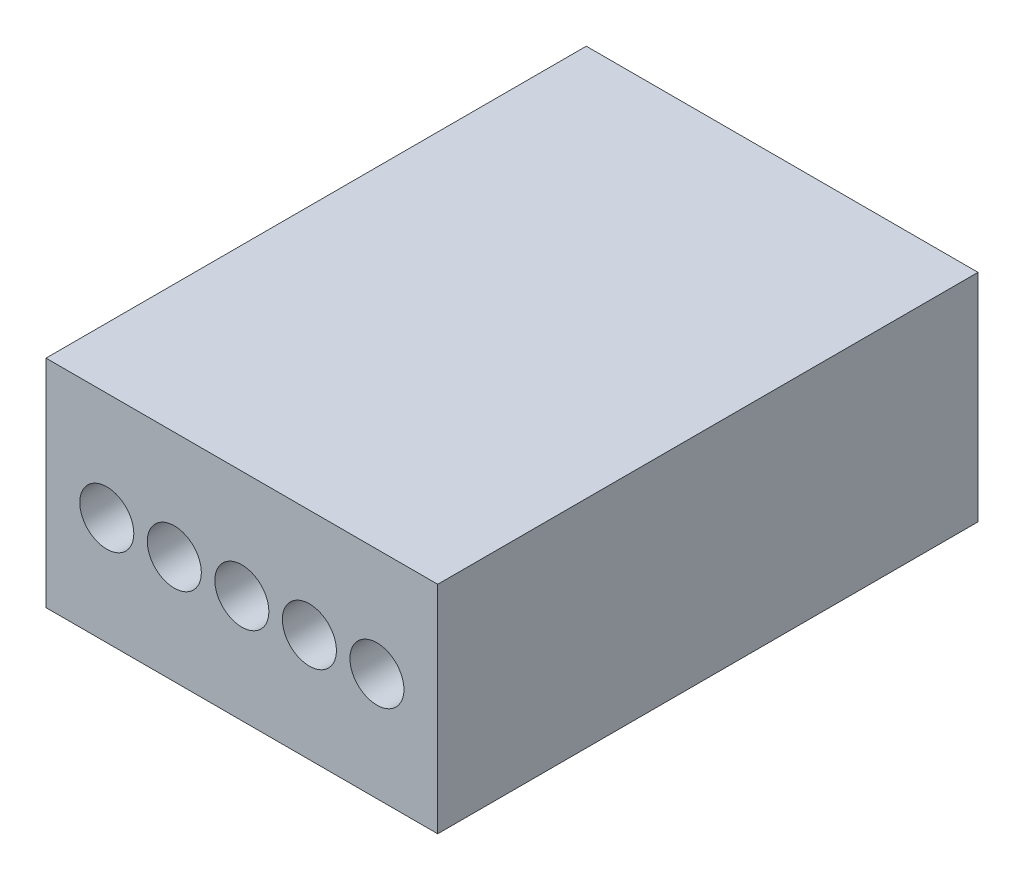
ISO-10303-21;
HEADER;
FILE_DESCRIPTION(('STEP AP214'),'2;1');
FILE_NAME('part.step','',(''),(''),'','','');
FILE_SCHEMA(('AUTOMOTIVE_DESIGN { 1 0 10303 214 1 1 1 1 }'));
ENDSEC;
DATA;
#1=APPLICATION_CONTEXT('core data for automotive mechanical design processes');
#2=APPLICATION_PROTOCOL_DEFINITION('international standard','automotive_design',2000,#1);
#3=PRODUCT_CONTEXT('',#1,'mechanical');
#4=PRODUCT('Part','Part','',(#3));
#5=PRODUCT_RELATED_PRODUCT_CATEGORY('part','',(#4));
#6=PRODUCT_DEFINITION_FORMATION('','',#4);
#7=PRODUCT_DEFINITION_CONTEXT('part definition',#1,'design');
#8=PRODUCT_DEFINITION('design','',#6,#7);
#9=PRODUCT_DEFINITION_SHAPE('','',#8);
#10=(LENGTH_UNIT() NAMED_UNIT(*) SI_UNIT(.MILLI.,.METRE.));
#11=(NAMED_UNIT(*) PLANE_ANGLE_UNIT() SI_UNIT($,.RADIAN.));
#12=(NAMED_UNIT(*) SI_UNIT($,.STERADIAN.) SOLID_ANGLE_UNIT());
#13=UNCERTAINTY_MEASURE_WITH_UNIT(LENGTH_MEASURE(1.E-05),#10,'distance_accuracy_value','');
#14=(GEOMETRIC_REPRESENTATION_CONTEXT(3) GLOBAL_UNCERTAINTY_ASSIGNED_CONTEXT((#13)) GLOBAL_UNIT_ASSIGNED_CONTEXT((#10,
#11,#12)) REPRESENTATION_CONTEXT('',''));
#15=CARTESIAN_POINT('',(0.,0.,0.));
#16=DIRECTION('',(0.,0.,1.));
#17=DIRECTION('',(1.,0.,0.));
#18=AXIS2_PLACEMENT_3D('',#15,#16,#17);
#19=CARTESIAN_POINT('',(0.,0.,10.));
#20=DIRECTION('',(1.,0.,0.));
#21=DIRECTION('',(0.,0.,-1.));
#22=AXIS2_PLACEMENT_3D('',#19,#20,#21);
#23=PLANE('',#22);
#24=DIRECTION('',(0.,-1.,0.));
#25=VECTOR('',#24,1.);
#26=CARTESIAN_POINT('',(0.,0.,0.));
#27=LINE('',#26,#25);
#28=CARTESIAN_POINT('',(0.,4.,0.));
#29=VERTEX_POINT('',#28);
#30=CARTESIAN_POINT('',(0.,0.,0.));
#31=VERTEX_POINT('',#30);
#32=EDGE_CURVE('E107',#29,#31,#27,.T.);
#33=ORIENTED_EDGE('',*,*,#32,.T.);
#34=DIRECTION('',(0.,0.,-1.));
#35=VECTOR('',#34,1.);
#36=CARTESIAN_POINT('',(0.,0.,10.));
#37=LINE('',#36,#35);
#38=CARTESIAN_POINT('',(0.,0.,10.));
#39=VERTEX_POINT('',#38);
#40=EDGE_CURVE('E11',#39,#31,#37,.T.);
#41=ORIENTED_EDGE('',*,*,#40,.F.);
#42=DIRECTION('',(0.,-1.,0.));
#43=VECTOR('',#42,1.);
#44=CARTESIAN_POINT('',(0.,0.,10.));
#45=LINE('',#44,#43);
#46=CARTESIAN_POINT('',(0.,4.,10.));
#47=VERTEX_POINT('',#46);
#48=EDGE_CURVE('E91',#47,#39,#45,.T.);
#49=ORIENTED_EDGE('',*,*,#48,.F.);
#50=DIRECTION('',(0.,0.,-1.));
#51=VECTOR('',#50,1.);
#52=CARTESIAN_POINT('',(0.,4.,10.));
#53=LINE('',#52,#51);
#54=EDGE_CURVE('E103',#47,#29,#53,.T.);
#55=ORIENTED_EDGE('',*,*,#54,.T.);
#56=EDGE_LOOP('',(#33,#41,#49,#55));
#57=FACE_BOUND('',#56,.T.);
#58=ADVANCED_FACE('F39',(#57),#23,.F.);
#59=CARTESIAN_POINT('',(0.,0.,10.));
#60=DIRECTION('',(0.,1.,0.));
#61=DIRECTION('',(0.,0.,1.));
#62=AXIS2_PLACEMENT_3D('',#59,#60,#61);
#63=PLANE('',#62);
#64=DIRECTION('',(1.,0.,0.));
#65=VECTOR('',#64,1.);
#66=CARTESIAN_POINT('',(0.,0.,0.));
#67=LINE('',#66,#65);
#68=CARTESIAN_POINT('',(7.25,0.,0.));
#69=VERTEX_POINT('',#68);
#70=EDGE_CURVE('E96',#31,#69,#67,.T.);
#71=ORIENTED_EDGE('',*,*,#70,.T.);
#72=DIRECTION('',(0.,0.,-1.));
#73=VECTOR('',#72,1.);
#74=CARTESIAN_POINT('',(7.25,0.,10.));
#75=LINE('',#74,#73);
#76=CARTESIAN_POINT('',(7.25,0.,10.));
#77=VERTEX_POINT('',#76);
#78=EDGE_CURVE('E48',#77,#69,#75,.T.);
#79=ORIENTED_EDGE('',*,*,#78,.F.);
#80=DIRECTION('',(1.,0.,0.));
#81=VECTOR('',#80,1.);
#82=CARTESIAN_POINT('',(0.,0.,10.));
#83=LINE('',#82,#81);
#84=EDGE_CURVE('E86',#39,#77,#83,.T.);
#85=ORIENTED_EDGE('',*,*,#84,.F.);
#86=ORIENTED_EDGE('',*,*,#40,.T.);
#87=EDGE_LOOP('',(#71,#79,#85,#86));
#88=FACE_BOUND('',#87,.T.);
#89=ADVANCED_FACE('F95',(#88),#63,.F.);
#90=CARTESIAN_POINT('',(7.25,0.,10.));
#91=DIRECTION('',(-1.,0.,0.));
#92=DIRECTION('',(0.,0.,1.));
#93=AXIS2_PLACEMENT_3D('',#90,#91,#92);
#94=PLANE('',#93);
#95=DIRECTION('',(0.,1.,0.));
#96=VECTOR('',#95,1.);
#97=CARTESIAN_POINT('',(7.25,0.,0.));
#98=LINE('',#97,#96);
#99=CARTESIAN_POINT('',(7.25,4.,0.));
#100=VERTEX_POINT('',#99);
#101=EDGE_CURVE('E73',#69,#100,#98,.T.);
#102=ORIENTED_EDGE('',*,*,#101,.T.);
#103=DIRECTION('',(0.,0.,-1.));
#104=VECTOR('',#103,1.);
#105=CARTESIAN_POINT('',(7.25,4.,10.));
#106=LINE('',#105,#104);
#107=CARTESIAN_POINT('',(7.25,4.,10.));
#108=VERTEX_POINT('',#107);
#109=EDGE_CURVE('E98',#108,#100,#106,.T.);
#110=ORIENTED_EDGE('',*,*,#109,.F.);
#111=DIRECTION('',(0.,1.,0.));
#112=VECTOR('',#111,1.);
#113=CARTESIAN_POINT('',(7.25,0.,10.));
#114=LINE('',#113,#112);
#115=EDGE_CURVE('E89',#77,#108,#114,.T.);
#116=ORIENTED_EDGE('',*,*,#115,.F.);
#117=ORIENTED_EDGE('',*,*,#78,.T.);
#118=EDGE_LOOP('',(#102,#110,#116,#117));
#119=FACE_BOUND('',#118,.T.);
#120=ADVANCED_FACE('F99',(#119),#94,.F.);
#121=CARTESIAN_POINT('',(0.,4.,10.));
#122=DIRECTION('',(0.,-1.,0.));
#123=DIRECTION('',(0.,0.,-1.));
#124=AXIS2_PLACEMENT_3D('',#121,#122,#123);
#125=PLANE('',#124);
#126=DIRECTION('',(-1.,0.,0.));
#127=VECTOR('',#126,1.);
#128=CARTESIAN_POINT('',(0.,4.,0.));
#129=LINE('',#128,#127);
#130=EDGE_CURVE('E79',#100,#29,#129,.T.);
#131=ORIENTED_EDGE('',*,*,#130,.T.);
#132=ORIENTED_EDGE('',*,*,#54,.F.);
#133=DIRECTION('',(-1.,0.,0.));
#134=VECTOR('',#133,1.);
#135=CARTESIAN_POINT('',(0.,4.,10.));
#136=LINE('',#135,#134);
#137=EDGE_CURVE('E56',#108,#47,#136,.T.);
#138=ORIENTED_EDGE('',*,*,#137,.F.);
#139=ORIENTED_EDGE('',*,*,#109,.T.);
#140=EDGE_LOOP('',(#131,#132,#138,#139));
#141=FACE_BOUND('',#140,.T.);
#142=ADVANCED_FACE('F121',(#141),#125,.F.);
#143=CARTESIAN_POINT('',(0.,0.,10.));
#144=DIRECTION('',(0.,0.,-1.));
#145=DIRECTION('',(-1.,0.,0.));
#146=AXIS2_PLACEMENT_3D('',#143,#144,#145);
#147=PLANE('',#146);
#148=CARTESIAN_POINT('',(1.125,2.,10.));
#149=DIRECTION('',(0.,0.,1.));
#150=DIRECTION('',(1.,0.,0.));
#151=AXIS2_PLACEMENT_3D('',#148,#149,#150);
#152=CIRCLE('',#151,0.5);
#153=CARTESIAN_POINT('',(1.625,2.,10.));
#154=VERTEX_POINT('',#153);
#155=EDGE_CURVE('E160',#154,#154,#152,.T.);
#156=ORIENTED_EDGE('',*,*,#155,.F.);
#157=EDGE_LOOP('',(#156));
#158=FACE_BOUND('',#157,.T.);
#159=CARTESIAN_POINT('',(2.375,2.,10.));
#160=DIRECTION('',(0.,0.,1.));
#161=DIRECTION('',(1.,0.,0.));
#162=AXIS2_PLACEMENT_3D('',#159,#160,#161);
#163=CIRCLE('',#162,0.5);
#164=CARTESIAN_POINT('',(2.875,2.,10.));
#165=VERTEX_POINT('',#164);
#166=EDGE_CURVE('E152',#165,#165,#163,.T.);
#167=ORIENTED_EDGE('',*,*,#166,.F.);
#168=EDGE_LOOP('',(#167));
#169=FACE_BOUND('',#168,.T.);
#170=CARTESIAN_POINT('',(3.625,2.,10.));
#171=DIRECTION('',(0.,0.,1.));
#172=DIRECTION('',(1.,0.,0.));
#173=AXIS2_PLACEMENT_3D('',#170,#171,#172);
#174=CIRCLE('',#173,0.5);
#175=CARTESIAN_POINT('',(4.125,2.,10.));
#176=VERTEX_POINT('',#175);
#177=EDGE_CURVE('E144',#176,#176,#174,.T.);
#178=ORIENTED_EDGE('',*,*,#177,.F.);
#179=EDGE_LOOP('',(#178));
#180=FACE_BOUND('',#179,.T.);
#181=CARTESIAN_POINT('',(4.875,2.,10.));
#182=DIRECTION('',(0.,0.,1.));
#183=DIRECTION('',(1.,0.,0.));
#184=AXIS2_PLACEMENT_3D('',#181,#182,#183);
#185=CIRCLE('',#184,0.5);
#186=CARTESIAN_POINT('',(5.375,2.,10.));
#187=VERTEX_POINT('',#186);
#188=EDGE_CURVE('E136',#187,#187,#185,.T.);
#189=ORIENTED_EDGE('',*,*,#188,.F.);
#190=EDGE_LOOP('',(#189));
#191=FACE_BOUND('',#190,.T.);
#192=CARTESIAN_POINT('',(6.125,2.,10.));
#193=DIRECTION('',(0.,0.,1.));
#194=DIRECTION('',(1.,0.,0.));
#195=AXIS2_PLACEMENT_3D('',#192,#193,#194);
#196=CIRCLE('',#195,0.5);
#197=CARTESIAN_POINT('',(6.625,2.,10.));
#198=VERTEX_POINT('',#197);
#199=EDGE_CURVE('E128',#198,#198,#196,.T.);
#200=ORIENTED_EDGE('',*,*,#199,.F.);
#201=EDGE_LOOP('',(#200));
#202=FACE_BOUND('',#201,.T.);
#203=ORIENTED_EDGE('',*,*,#48,.T.);
#204=ORIENTED_EDGE('',*,*,#84,.T.);
#205=ORIENTED_EDGE('',*,*,#115,.T.);
#206=ORIENTED_EDGE('',*,*,#137,.T.);
#207=EDGE_LOOP('',(#203,#204,#205,#206));
#208=FACE_BOUND('',#207,.T.);
#209=ADVANCED_FACE('F87',(#158,#169,#180,#191,#202,#208),#147,.F.);
#210=CARTESIAN_POINT('',(0.,0.,0.));
#211=DIRECTION('',(0.,0.,-1.));
#212=DIRECTION('',(-1.,0.,0.));
#213=AXIS2_PLACEMENT_3D('',#210,#211,#212);
#214=PLANE('',#213);
#215=ORIENTED_EDGE('',*,*,#32,.F.);
#216=ORIENTED_EDGE('',*,*,#130,.F.);
#217=ORIENTED_EDGE('',*,*,#101,.F.);
#218=ORIENTED_EDGE('',*,*,#70,.F.);
#219=EDGE_LOOP('',(#215,#216,#217,#218));
#220=FACE_BOUND('',#219,.T.);
#221=ADVANCED_FACE('F124',(#220),#214,.T.);
#222=CARTESIAN_POINT('',(6.125,2.,5.));
#223=DIRECTION('',(0.,0.,1.));
#224=DIRECTION('',(1.,0.,0.));
#225=AXIS2_PLACEMENT_3D('',#222,#223,#224);
#226=CYLINDRICAL_SURFACE('',#225,0.5);
#227=CARTESIAN_POINT('',(6.125,2.,5.));
#228=DIRECTION('',(0.,0.,1.));
#229=DIRECTION('',(1.,0.,0.));
#230=AXIS2_PLACEMENT_3D('',#227,#228,#229);
#231=CIRCLE('',#230,0.5);
#232=CARTESIAN_POINT('',(6.625,2.,5.));
#233=VERTEX_POINT('',#232);
#234=EDGE_CURVE('E132',#233,#233,#231,.T.);
#235=ORIENTED_EDGE('',*,*,#234,.F.);
#236=EDGE_LOOP('',(#235));
#237=FACE_BOUND('',#236,.T.);
#238=ORIENTED_EDGE('',*,*,#199,.T.);
#239=EDGE_LOOP('',(#238));
#240=FACE_BOUND('',#239,.T.);
#241=ADVANCED_FACE('F188',(#237,#240),#226,.F.);
#242=CARTESIAN_POINT('',(6.125,2.,5.));
#243=DIRECTION('',(0.,0.,1.));
#244=DIRECTION('',(1.,0.,0.));
#245=AXIS2_PLACEMENT_3D('',#242,#243,#244);
#246=PLANE('',#245);
#247=ORIENTED_EDGE('',*,*,#234,.T.);
#248=EDGE_LOOP('',(#247));
#249=FACE_BOUND('',#248,.T.);
#250=ADVANCED_FACE('F190',(#249),#246,.T.);
#251=CARTESIAN_POINT('',(4.875,2.,5.));
#252=DIRECTION('',(0.,0.,1.));
#253=DIRECTION('',(1.,0.,0.));
#254=AXIS2_PLACEMENT_3D('',#251,#252,#253);
#255=CYLINDRICAL_SURFACE('',#254,0.5);
#256=CARTESIAN_POINT('',(4.875,2.,5.));
#257=DIRECTION('',(0.,0.,1.));
#258=DIRECTION('',(1.,0.,0.));
#259=AXIS2_PLACEMENT_3D('',#256,#257,#258);
#260=CIRCLE('',#259,0.5);
#261=CARTESIAN_POINT('',(5.375,2.,5.));
#262=VERTEX_POINT('',#261);
#263=EDGE_CURVE('E140',#262,#262,#260,.T.);
#264=ORIENTED_EDGE('',*,*,#263,.F.);
#265=EDGE_LOOP('',(#264));
#266=FACE_BOUND('',#265,.T.);
#267=ORIENTED_EDGE('',*,*,#188,.T.);
#268=EDGE_LOOP('',(#267));
#269=FACE_BOUND('',#268,.T.);
#270=ADVANCED_FACE('F197',(#266,#269),#255,.F.);
#271=CARTESIAN_POINT('',(4.875,2.,5.));
#272=DIRECTION('',(0.,0.,1.));
#273=DIRECTION('',(1.,0.,0.));
#274=AXIS2_PLACEMENT_3D('',#271,#272,#273);
#275=PLANE('',#274);
#276=ORIENTED_EDGE('',*,*,#263,.T.);
#277=EDGE_LOOP('',(#276));
#278=FACE_BOUND('',#277,.T.);
#279=ADVANCED_FACE('F245',(#278),#275,.T.);
#280=CARTESIAN_POINT('',(3.625,2.,5.));
#281=DIRECTION('',(0.,0.,1.));
#282=DIRECTION('',(1.,0.,0.));
#283=AXIS2_PLACEMENT_3D('',#280,#281,#282);
#284=CYLINDRICAL_SURFACE('',#283,0.5);
#285=CARTESIAN_POINT('',(3.625,2.,5.));
#286=DIRECTION('',(0.,0.,1.));
#287=DIRECTION('',(1.,0.,0.));
#288=AXIS2_PLACEMENT_3D('',#285,#286,#287);
#289=CIRCLE('',#288,0.5);
#290=CARTESIAN_POINT('',(4.125,2.,5.));
#291=VERTEX_POINT('',#290);
#292=EDGE_CURVE('E148',#291,#291,#289,.T.);
#293=ORIENTED_EDGE('',*,*,#292,.F.);
#294=EDGE_LOOP('',(#293));
#295=FACE_BOUND('',#294,.T.);
#296=ORIENTED_EDGE('',*,*,#177,.T.);
#297=EDGE_LOOP('',(#296));
#298=FACE_BOUND('',#297,.T.);
#299=ADVANCED_FACE('F254',(#295,#298),#284,.F.);
#300=CARTESIAN_POINT('',(3.625,2.,5.));
#301=DIRECTION('',(0.,0.,1.));
#302=DIRECTION('',(1.,0.,0.));
#303=AXIS2_PLACEMENT_3D('',#300,#301,#302);
#304=PLANE('',#303);
#305=ORIENTED_EDGE('',*,*,#292,.T.);
#306=EDGE_LOOP('',(#305));
#307=FACE_BOUND('',#306,.T.);
#308=ADVANCED_FACE('F263',(#307),#304,.T.);
#309=CARTESIAN_POINT('',(2.375,2.,5.));
#310=DIRECTION('',(0.,0.,1.));
#311=DIRECTION('',(1.,0.,0.));
#312=AXIS2_PLACEMENT_3D('',#309,#310,#311);
#313=CYLINDRICAL_SURFACE('',#312,0.5);
#314=CARTESIAN_POINT('',(2.375,2.,5.));
#315=DIRECTION('',(0.,0.,1.));
#316=DIRECTION('',(1.,0.,0.));
#317=AXIS2_PLACEMENT_3D('',#314,#315,#316);
#318=CIRCLE('',#317,0.5);
#319=CARTESIAN_POINT('',(2.875,2.,5.));
#320=VERTEX_POINT('',#319);
#321=EDGE_CURVE('E156',#320,#320,#318,.T.);
#322=ORIENTED_EDGE('',*,*,#321,.F.);
#323=EDGE_LOOP('',(#322));
#324=FACE_BOUND('',#323,.T.);
#325=ORIENTED_EDGE('',*,*,#166,.T.);
#326=EDGE_LOOP('',(#325));
#327=FACE_BOUND('',#326,.T.);
#328=ADVANCED_FACE('F272',(#324,#327),#313,.F.);
#329=CARTESIAN_POINT('',(2.375,2.,5.));
#330=DIRECTION('',(0.,0.,1.));
#331=DIRECTION('',(1.,0.,0.));
#332=AXIS2_PLACEMENT_3D('',#329,#330,#331);
#333=PLANE('',#332);
#334=ORIENTED_EDGE('',*,*,#321,.T.);
#335=EDGE_LOOP('',(#334));
#336=FACE_BOUND('',#335,.T.);
#337=ADVANCED_FACE('F173',(#336),#333,.T.);
#338=CARTESIAN_POINT('',(1.125,2.,5.));
#339=DIRECTION('',(0.,0.,1.));
#340=DIRECTION('',(1.,0.,0.));
#341=AXIS2_PLACEMENT_3D('',#338,#339,#340);
#342=CYLINDRICAL_SURFACE('',#341,0.5);
#343=CARTESIAN_POINT('',(1.125,2.,5.));
#344=DIRECTION('',(0.,0.,1.));
#345=DIRECTION('',(1.,0.,0.));
#346=AXIS2_PLACEMENT_3D('',#343,#344,#345);
#347=CIRCLE('',#346,0.5);
#348=CARTESIAN_POINT('',(1.625,2.,5.));
#349=VERTEX_POINT('',#348);
#350=EDGE_CURVE('E111',#349,#349,#347,.T.);
#351=ORIENTED_EDGE('',*,*,#350,.F.);
#352=EDGE_LOOP('',(#351));
#353=FACE_BOUND('',#352,.T.);
#354=ORIENTED_EDGE('',*,*,#155,.T.);
#355=EDGE_LOOP('',(#354));
#356=FACE_BOUND('',#355,.T.);
#357=ADVANCED_FACE('F170',(#353,#356),#342,.F.);
#358=CARTESIAN_POINT('',(1.125,2.,5.));
#359=DIRECTION('',(0.,0.,1.));
#360=DIRECTION('',(1.,0.,0.));
#361=AXIS2_PLACEMENT_3D('',#358,#359,#360);
#362=PLANE('',#361);
#363=ORIENTED_EDGE('',*,*,#350,.T.);
#364=EDGE_LOOP('',(#363));
#365=FACE_BOUND('',#364,.T.);
#366=ADVANCED_FACE('F168',(#365),#362,.T.);
#367=CLOSED_SHELL('',(#58,#89,#120,#142,#209,#221,#241,#250,#270,#279,#299,#308,#328,#337,#357,#366));
#368=MANIFOLD_SOLID_BREP('B2',#367);
#369=ADVANCED_BREP_SHAPE_REPRESENTATION('',(#18,#368),#14);
#370=SHAPE_DEFINITION_REPRESENTATION(#9,#369);
ENDSEC;
END-ISO-10303-21;
